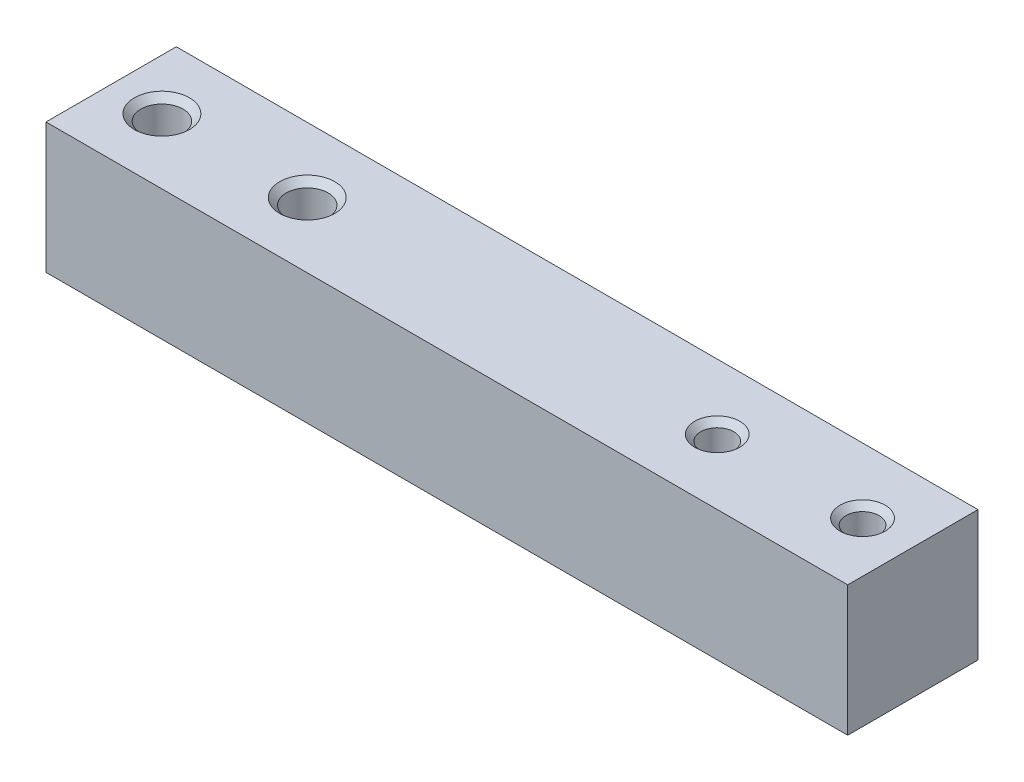
ISO-10303-21;
HEADER;
FILE_DESCRIPTION(('STEP AP214'),'2;1');
FILE_NAME('part.step','',(''),(''),'','','');
FILE_SCHEMA(('AUTOMOTIVE_DESIGN { 1 0 10303 214 1 1 1 1 }'));
ENDSEC;
DATA;
#1=APPLICATION_CONTEXT('core data for automotive mechanical design processes');
#2=APPLICATION_PROTOCOL_DEFINITION('international standard','automotive_design',2000,#1);
#3=PRODUCT_CONTEXT('',#1,'mechanical');
#4=PRODUCT('Part','Part','',(#3));
#5=PRODUCT_RELATED_PRODUCT_CATEGORY('part','',(#4));
#6=PRODUCT_DEFINITION_FORMATION('','',#4);
#7=PRODUCT_DEFINITION_CONTEXT('part definition',#1,'design');
#8=PRODUCT_DEFINITION('design','',#6,#7);
#9=PRODUCT_DEFINITION_SHAPE('','',#8);
#10=(LENGTH_UNIT() NAMED_UNIT(*) SI_UNIT(.MILLI.,.METRE.));
#11=(NAMED_UNIT(*) PLANE_ANGLE_UNIT() SI_UNIT($,.RADIAN.));
#12=(NAMED_UNIT(*) SI_UNIT($,.STERADIAN.) SOLID_ANGLE_UNIT());
#13=UNCERTAINTY_MEASURE_WITH_UNIT(LENGTH_MEASURE(1.E-05),#10,'distance_accuracy_value','');
#14=(GEOMETRIC_REPRESENTATION_CONTEXT(3) GLOBAL_UNCERTAINTY_ASSIGNED_CONTEXT((#13)) GLOBAL_UNIT_ASSIGNED_CONTEXT((#10,
#11,#12)) REPRESENTATION_CONTEXT('',''));
#15=CARTESIAN_POINT('',(0.,0.,0.));
#16=DIRECTION('',(0.,0.,1.));
#17=DIRECTION('',(1.,0.,0.));
#18=AXIS2_PLACEMENT_3D('',#15,#16,#17);
#19=CARTESIAN_POINT('',(0.,0.,0.));
#20=DIRECTION('',(0.,-1.,0.));
#21=DIRECTION('',(0.,0.,-1.));
#22=AXIS2_PLACEMENT_3D('',#19,#20,#21);
#23=PLANE('',#22);
#24=CARTESIAN_POINT('',(5.067,0.,-6.5));
#25=DIRECTION('',(0.,1.,0.));
#26=DIRECTION('',(0.,0.,1.));
#27=AXIS2_PLACEMENT_3D('',#24,#25,#26);
#28=CIRCLE('',#27,2.1);
#29=CARTESIAN_POINT('',(5.067,0.,-4.4));
#30=VERTEX_POINT('',#29);
#31=EDGE_CURVE('E142',#30,#30,#28,.T.);
#32=ORIENTED_EDGE('',*,*,#31,.T.);
#33=EDGE_LOOP('',(#32));
#34=FACE_BOUND('',#33,.T.);
#35=CARTESIAN_POINT('',(19.567,0.,-6.5));
#36=DIRECTION('',(0.,1.,0.));
#37=DIRECTION('',(0.,0.,1.));
#38=AXIS2_PLACEMENT_3D('',#35,#36,#37);
#39=CIRCLE('',#38,2.1);
#40=CARTESIAN_POINT('',(19.567,0.,-4.4));
#41=VERTEX_POINT('',#40);
#42=EDGE_CURVE('E133',#41,#41,#39,.T.);
#43=ORIENTED_EDGE('',*,*,#42,.T.);
#44=EDGE_LOOP('',(#43));
#45=FACE_BOUND('',#44,.T.);
#46=DIRECTION('',(0.,0.,1.));
#47=VECTOR('',#46,1.);
#48=CARTESIAN_POINT('',(0.,0.,0.));
#49=LINE('',#48,#47);
#50=CARTESIAN_POINT('',(0.,0.,-13.));
#51=VERTEX_POINT('',#50);
#52=CARTESIAN_POINT('',(0.,0.,0.));
#53=VERTEX_POINT('',#52);
#54=EDGE_CURVE('E102',#51,#53,#49,.T.);
#55=ORIENTED_EDGE('',*,*,#54,.F.);
#56=DIRECTION('',(-1.,0.,0.));
#57=VECTOR('',#56,1.);
#58=CARTESIAN_POINT('',(0.,0.,-13.));
#59=LINE('',#58,#57);
#60=CARTESIAN_POINT('',(80.,0.,-13.));
#61=VERTEX_POINT('',#60);
#62=EDGE_CURVE('E78',#61,#51,#59,.T.);
#63=ORIENTED_EDGE('',*,*,#62,.F.);
#64=DIRECTION('',(0.,0.,-1.));
#65=VECTOR('',#64,1.);
#66=CARTESIAN_POINT('',(80.,0.,0.));
#67=LINE('',#66,#65);
#68=CARTESIAN_POINT('',(80.,0.,0.));
#69=VERTEX_POINT('',#68);
#70=EDGE_CURVE('E72',#69,#61,#67,.T.);
#71=ORIENTED_EDGE('',*,*,#70,.F.);
#72=DIRECTION('',(1.,0.,0.));
#73=VECTOR('',#72,1.);
#74=CARTESIAN_POINT('',(0.,0.,0.));
#75=LINE('',#74,#73);
#76=EDGE_CURVE('E94',#53,#69,#75,.T.);
#77=ORIENTED_EDGE('',*,*,#76,.F.);
#78=EDGE_LOOP('',(#55,#63,#71,#77));
#79=FACE_BOUND('',#78,.T.);
#80=CARTESIAN_POINT('',(60.479,0.,-6.5));
#81=DIRECTION('',(0.,1.,0.));
#82=DIRECTION('',(0.,0.,1.));
#83=AXIS2_PLACEMENT_3D('',#80,#81,#82);
#84=CIRCLE('',#83,1.65);
#85=CARTESIAN_POINT('',(60.479,0.,-4.85));
#86=VERTEX_POINT('',#85);
#87=EDGE_CURVE('E105',#86,#86,#84,.T.);
#88=ORIENTED_EDGE('',*,*,#87,.T.);
#89=EDGE_LOOP('',(#88));
#90=FACE_BOUND('',#89,.T.);
#91=CARTESIAN_POINT('',(74.979,0.,-6.5));
#92=DIRECTION('',(0.,1.,0.));
#93=DIRECTION('',(0.,0.,1.));
#94=AXIS2_PLACEMENT_3D('',#91,#92,#93);
#95=CIRCLE('',#94,1.65);
#96=CARTESIAN_POINT('',(74.979,0.,-4.85));
#97=VERTEX_POINT('',#96);
#98=EDGE_CURVE('E124',#97,#97,#95,.T.);
#99=ORIENTED_EDGE('',*,*,#98,.T.);
#100=EDGE_LOOP('',(#99));
#101=FACE_BOUND('',#100,.T.);
#102=ADVANCED_FACE('F38',(#34,#45,#79,#90,#101),#23,.T.);
#103=CARTESIAN_POINT('',(0.,13.,0.));
#104=DIRECTION('',(1.,0.,0.));
#105=DIRECTION('',(0.,0.,-1.));
#106=AXIS2_PLACEMENT_3D('',#103,#104,#105);
#107=PLANE('',#106);
#108=ORIENTED_EDGE('',*,*,#54,.T.);
#109=DIRECTION('',(0.,-1.,0.));
#110=VECTOR('',#109,1.);
#111=CARTESIAN_POINT('',(0.,13.,0.));
#112=LINE('',#111,#110);
#113=CARTESIAN_POINT('',(0.,13.,0.));
#114=VERTEX_POINT('',#113);
#115=EDGE_CURVE('E11',#114,#53,#112,.T.);
#116=ORIENTED_EDGE('',*,*,#115,.F.);
#117=DIRECTION('',(0.,0.,1.));
#118=VECTOR('',#117,1.);
#119=CARTESIAN_POINT('',(0.,13.,0.));
#120=LINE('',#119,#118);
#121=CARTESIAN_POINT('',(0.,13.,-13.));
#122=VERTEX_POINT('',#121);
#123=EDGE_CURVE('E90',#122,#114,#120,.T.);
#124=ORIENTED_EDGE('',*,*,#123,.F.);
#125=DIRECTION('',(0.,-1.,0.));
#126=VECTOR('',#125,1.);
#127=CARTESIAN_POINT('',(0.,13.,-13.));
#128=LINE('',#127,#126);
#129=EDGE_CURVE('E98',#122,#51,#128,.T.);
#130=ORIENTED_EDGE('',*,*,#129,.T.);
#131=EDGE_LOOP('',(#108,#116,#124,#130));
#132=FACE_BOUND('',#131,.T.);
#133=ADVANCED_FACE('F40',(#132),#107,.F.);
#134=CARTESIAN_POINT('',(0.,13.,0.));
#135=DIRECTION('',(0.,0.,-1.));
#136=DIRECTION('',(-1.,0.,0.));
#137=AXIS2_PLACEMENT_3D('',#134,#135,#136);
#138=PLANE('',#137);
#139=ORIENTED_EDGE('',*,*,#76,.T.);
#140=DIRECTION('',(0.,-1.,0.));
#141=VECTOR('',#140,1.);
#142=CARTESIAN_POINT('',(80.,13.,0.));
#143=LINE('',#142,#141);
#144=CARTESIAN_POINT('',(80.,13.,0.));
#145=VERTEX_POINT('',#144);
#146=EDGE_CURVE('E47',#145,#69,#143,.T.);
#147=ORIENTED_EDGE('',*,*,#146,.F.);
#148=DIRECTION('',(1.,0.,0.));
#149=VECTOR('',#148,1.);
#150=CARTESIAN_POINT('',(0.,13.,0.));
#151=LINE('',#150,#149);
#152=EDGE_CURVE('E85',#114,#145,#151,.T.);
#153=ORIENTED_EDGE('',*,*,#152,.F.);
#154=ORIENTED_EDGE('',*,*,#115,.T.);
#155=EDGE_LOOP('',(#139,#147,#153,#154));
#156=FACE_BOUND('',#155,.T.);
#157=ADVANCED_FACE('F93',(#156),#138,.F.);
#158=CARTESIAN_POINT('',(80.,13.,0.));
#159=DIRECTION('',(-1.,0.,0.));
#160=DIRECTION('',(0.,0.,1.));
#161=AXIS2_PLACEMENT_3D('',#158,#159,#160);
#162=PLANE('',#161);
#163=ORIENTED_EDGE('',*,*,#70,.T.);
#164=DIRECTION('',(0.,-1.,0.));
#165=VECTOR('',#164,1.);
#166=CARTESIAN_POINT('',(80.,13.,-13.));
#167=LINE('',#166,#165);
#168=CARTESIAN_POINT('',(80.,13.,-13.));
#169=VERTEX_POINT('',#168);
#170=EDGE_CURVE('E95',#169,#61,#167,.T.);
#171=ORIENTED_EDGE('',*,*,#170,.F.);
#172=DIRECTION('',(0.,0.,-1.));
#173=VECTOR('',#172,1.);
#174=CARTESIAN_POINT('',(80.,13.,0.));
#175=LINE('',#174,#173);
#176=EDGE_CURVE('E88',#145,#169,#175,.T.);
#177=ORIENTED_EDGE('',*,*,#176,.F.);
#178=ORIENTED_EDGE('',*,*,#146,.T.);
#179=EDGE_LOOP('',(#163,#171,#177,#178));
#180=FACE_BOUND('',#179,.T.);
#181=ADVANCED_FACE('F96',(#180),#162,.F.);
#182=CARTESIAN_POINT('',(0.,13.,-13.));
#183=DIRECTION('',(0.,0.,1.));
#184=DIRECTION('',(1.,0.,0.));
#185=AXIS2_PLACEMENT_3D('',#182,#183,#184);
#186=PLANE('',#185);
#187=ORIENTED_EDGE('',*,*,#62,.T.);
#188=ORIENTED_EDGE('',*,*,#129,.F.);
#189=DIRECTION('',(-1.,0.,0.));
#190=VECTOR('',#189,1.);
#191=CARTESIAN_POINT('',(0.,13.,-13.));
#192=LINE('',#191,#190);
#193=EDGE_CURVE('E55',#169,#122,#192,.T.);
#194=ORIENTED_EDGE('',*,*,#193,.F.);
#195=ORIENTED_EDGE('',*,*,#170,.T.);
#196=EDGE_LOOP('',(#187,#188,#194,#195));
#197=FACE_BOUND('',#196,.T.);
#198=ADVANCED_FACE('F110',(#197),#186,.F.);
#199=CARTESIAN_POINT('',(0.,13.,0.));
#200=DIRECTION('',(0.,-1.,0.));
#201=DIRECTION('',(0.,0.,-1.));
#202=AXIS2_PLACEMENT_3D('',#199,#200,#201);
#203=PLANE('',#202);
#204=CARTESIAN_POINT('',(5.067,13.,-6.5));
#205=DIRECTION('',(0.,1.,0.));
#206=DIRECTION('',(0.,0.,1.));
#207=AXIS2_PLACEMENT_3D('',#204,#205,#206);
#208=CIRCLE('',#207,2.75);
#209=CARTESIAN_POINT('',(5.067,13.,-3.75));
#210=VERTEX_POINT('',#209);
#211=EDGE_CURVE('E148',#210,#210,#208,.T.);
#212=ORIENTED_EDGE('',*,*,#211,.F.);
#213=EDGE_LOOP('',(#212));
#214=FACE_BOUND('',#213,.T.);
#215=CARTESIAN_POINT('',(19.567,13.,-6.5));
#216=DIRECTION('',(0.,1.,0.));
#217=DIRECTION('',(0.,0.,1.));
#218=AXIS2_PLACEMENT_3D('',#215,#216,#217);
#219=CIRCLE('',#218,2.75);
#220=CARTESIAN_POINT('',(19.567,13.,-3.75));
#221=VERTEX_POINT('',#220);
#222=EDGE_CURVE('E139',#221,#221,#219,.T.);
#223=ORIENTED_EDGE('',*,*,#222,.F.);
#224=EDGE_LOOP('',(#223));
#225=FACE_BOUND('',#224,.T.);
#226=CARTESIAN_POINT('',(74.979,13.,-6.5));
#227=DIRECTION('',(0.,1.,0.));
#228=DIRECTION('',(0.,0.,1.));
#229=AXIS2_PLACEMENT_3D('',#226,#227,#228);
#230=CIRCLE('',#229,2.25);
#231=CARTESIAN_POINT('',(74.979,13.,-4.25));
#232=VERTEX_POINT('',#231);
#233=EDGE_CURVE('E130',#232,#232,#230,.T.);
#234=ORIENTED_EDGE('',*,*,#233,.F.);
#235=EDGE_LOOP('',(#234));
#236=FACE_BOUND('',#235,.T.);
#237=CARTESIAN_POINT('',(60.479,13.,-6.5));
#238=DIRECTION('',(0.,1.,0.));
#239=DIRECTION('',(0.,0.,1.));
#240=AXIS2_PLACEMENT_3D('',#237,#238,#239);
#241=CIRCLE('',#240,2.25);
#242=CARTESIAN_POINT('',(60.479,13.,-4.25));
#243=VERTEX_POINT('',#242);
#244=EDGE_CURVE('E121',#243,#243,#241,.T.);
#245=ORIENTED_EDGE('',*,*,#244,.F.);
#246=EDGE_LOOP('',(#245));
#247=FACE_BOUND('',#246,.T.);
#248=ORIENTED_EDGE('',*,*,#123,.T.);
#249=ORIENTED_EDGE('',*,*,#152,.T.);
#250=ORIENTED_EDGE('',*,*,#176,.T.);
#251=ORIENTED_EDGE('',*,*,#193,.T.);
#252=EDGE_LOOP('',(#248,#249,#250,#251));
#253=FACE_BOUND('',#252,.T.);
#254=ADVANCED_FACE('F86',(#214,#225,#236,#247,#253),#203,.F.);
#255=CARTESIAN_POINT('',(60.479,13.,-6.5));
#256=DIRECTION('',(0.,1.,0.));
#257=DIRECTION('',(0.,0.,1.));
#258=AXIS2_PLACEMENT_3D('',#255,#256,#257);
#259=CYLINDRICAL_SURFACE('',#258,1.65);
#260=ORIENTED_EDGE('',*,*,#87,.F.);
#261=EDGE_LOOP('',(#260));
#262=FACE_BOUND('',#261,.T.);
#263=CARTESIAN_POINT('',(60.479,12.4,-6.5));
#264=DIRECTION('',(0.,1.,0.));
#265=DIRECTION('',(0.,0.,1.));
#266=AXIS2_PLACEMENT_3D('',#263,#264,#265);
#267=CIRCLE('',#266,1.65);
#268=CARTESIAN_POINT('',(60.479,12.4,-4.85));
#269=VERTEX_POINT('',#268);
#270=EDGE_CURVE('E118',#269,#269,#267,.T.);
#271=ORIENTED_EDGE('',*,*,#270,.T.);
#272=EDGE_LOOP('',(#271));
#273=FACE_BOUND('',#272,.T.);
#274=ADVANCED_FACE('F156',(#262,#273),#259,.F.);
#275=CARTESIAN_POINT('',(60.479,13.,-6.5));
#276=DIRECTION('',(0.,1.,0.));
#277=DIRECTION('',(0.,0.,1.));
#278=AXIS2_PLACEMENT_3D('',#275,#276,#277);
#279=CONICAL_SURFACE('',#278,2.25,0.78539816339745);
#280=ORIENTED_EDGE('',*,*,#270,.F.);
#281=EDGE_LOOP('',(#280));
#282=FACE_BOUND('',#281,.T.);
#283=ORIENTED_EDGE('',*,*,#244,.T.);
#284=EDGE_LOOP('',(#283));
#285=FACE_BOUND('',#284,.T.);
#286=ADVANCED_FACE('F164',(#282,#285),#279,.F.);
#287=CARTESIAN_POINT('',(74.979,13.,-6.5));
#288=DIRECTION('',(0.,1.,0.));
#289=DIRECTION('',(0.,0.,1.));
#290=AXIS2_PLACEMENT_3D('',#287,#288,#289);
#291=CYLINDRICAL_SURFACE('',#290,1.65);
#292=ORIENTED_EDGE('',*,*,#98,.F.);
#293=EDGE_LOOP('',(#292));
#294=FACE_BOUND('',#293,.T.);
#295=CARTESIAN_POINT('',(74.979,12.4,-6.5));
#296=DIRECTION('',(0.,1.,0.));
#297=DIRECTION('',(0.,0.,1.));
#298=AXIS2_PLACEMENT_3D('',#295,#296,#297);
#299=CIRCLE('',#298,1.65);
#300=CARTESIAN_POINT('',(74.979,12.4,-4.85));
#301=VERTEX_POINT('',#300);
#302=EDGE_CURVE('E127',#301,#301,#299,.T.);
#303=ORIENTED_EDGE('',*,*,#302,.T.);
#304=EDGE_LOOP('',(#303));
#305=FACE_BOUND('',#304,.T.);
#306=ADVANCED_FACE('F166',(#294,#305),#291,.F.);
#307=CARTESIAN_POINT('',(74.979,13.,-6.5));
#308=DIRECTION('',(0.,1.,0.));
#309=DIRECTION('',(0.,0.,1.));
#310=AXIS2_PLACEMENT_3D('',#307,#308,#309);
#311=CONICAL_SURFACE('',#310,2.25,0.78539816339745);
#312=ORIENTED_EDGE('',*,*,#302,.F.);
#313=EDGE_LOOP('',(#312));
#314=FACE_BOUND('',#313,.T.);
#315=ORIENTED_EDGE('',*,*,#233,.T.);
#316=EDGE_LOOP('',(#315));
#317=FACE_BOUND('',#316,.T.);
#318=ADVANCED_FACE('F173',(#314,#317),#311,.F.);
#319=CARTESIAN_POINT('',(19.567,13.,-6.5));
#320=DIRECTION('',(0.,1.,0.));
#321=DIRECTION('',(0.,0.,1.));
#322=AXIS2_PLACEMENT_3D('',#319,#320,#321);
#323=CYLINDRICAL_SURFACE('',#322,2.1);
#324=ORIENTED_EDGE('',*,*,#42,.F.);
#325=EDGE_LOOP('',(#324));
#326=FACE_BOUND('',#325,.T.);
#327=CARTESIAN_POINT('',(19.567,12.35,-6.5));
#328=DIRECTION('',(0.,1.,0.));
#329=DIRECTION('',(0.,0.,1.));
#330=AXIS2_PLACEMENT_3D('',#327,#328,#329);
#331=CIRCLE('',#330,2.1);
#332=CARTESIAN_POINT('',(19.567,12.35,-4.4));
#333=VERTEX_POINT('',#332);
#334=EDGE_CURVE('E136',#333,#333,#331,.T.);
#335=ORIENTED_EDGE('',*,*,#334,.T.);
#336=EDGE_LOOP('',(#335));
#337=FACE_BOUND('',#336,.T.);
#338=ADVANCED_FACE('F231',(#326,#337),#323,.F.);
#339=CARTESIAN_POINT('',(19.567,13.,-6.5));
#340=DIRECTION('',(0.,1.,0.));
#341=DIRECTION('',(0.,0.,1.));
#342=AXIS2_PLACEMENT_3D('',#339,#340,#341);
#343=CONICAL_SURFACE('',#342,2.75,0.78539816339745);
#344=ORIENTED_EDGE('',*,*,#334,.F.);
#345=EDGE_LOOP('',(#344));
#346=FACE_BOUND('',#345,.T.);
#347=ORIENTED_EDGE('',*,*,#222,.T.);
#348=EDGE_LOOP('',(#347));
#349=FACE_BOUND('',#348,.T.);
#350=ADVANCED_FACE('F256',(#346,#349),#343,.F.);
#351=CARTESIAN_POINT('',(5.067,13.,-6.5));
#352=DIRECTION('',(0.,1.,0.));
#353=DIRECTION('',(0.,0.,1.));
#354=AXIS2_PLACEMENT_3D('',#351,#352,#353);
#355=CYLINDRICAL_SURFACE('',#354,2.1);
#356=ORIENTED_EDGE('',*,*,#31,.F.);
#357=EDGE_LOOP('',(#356));
#358=FACE_BOUND('',#357,.T.);
#359=CARTESIAN_POINT('',(5.067,12.35,-6.5));
#360=DIRECTION('',(0.,1.,0.));
#361=DIRECTION('',(0.,0.,1.));
#362=AXIS2_PLACEMENT_3D('',#359,#360,#361);
#363=CIRCLE('',#362,2.1);
#364=CARTESIAN_POINT('',(5.067,12.35,-4.4));
#365=VERTEX_POINT('',#364);
#366=EDGE_CURVE('E145',#365,#365,#363,.T.);
#367=ORIENTED_EDGE('',*,*,#366,.T.);
#368=EDGE_LOOP('',(#367));
#369=FACE_BOUND('',#368,.T.);
#370=ADVANCED_FACE('F263',(#358,#369),#355,.F.);
#371=CARTESIAN_POINT('',(5.067,13.,-6.5));
#372=DIRECTION('',(0.,1.,0.));
#373=DIRECTION('',(0.,0.,1.));
#374=AXIS2_PLACEMENT_3D('',#371,#372,#373);
#375=CONICAL_SURFACE('',#374,2.75,0.78539816339745);
#376=ORIENTED_EDGE('',*,*,#366,.F.);
#377=EDGE_LOOP('',(#376));
#378=FACE_BOUND('',#377,.T.);
#379=ORIENTED_EDGE('',*,*,#211,.T.);
#380=EDGE_LOOP('',(#379));
#381=FACE_BOUND('',#380,.T.);
#382=ADVANCED_FACE('F152',(#378,#381),#375,.F.);
#383=CLOSED_SHELL('',(#102,#133,#157,#181,#198,#254,#274,#286,#306,#318,#338,#350,#370,#382));
#384=MANIFOLD_SOLID_BREP('B2',#383);
#385=ADVANCED_BREP_SHAPE_REPRESENTATION('',(#18,#384),#14);
#386=SHAPE_DEFINITION_REPRESENTATION(#9,#385);
ENDSEC;
END-ISO-10303-21;
